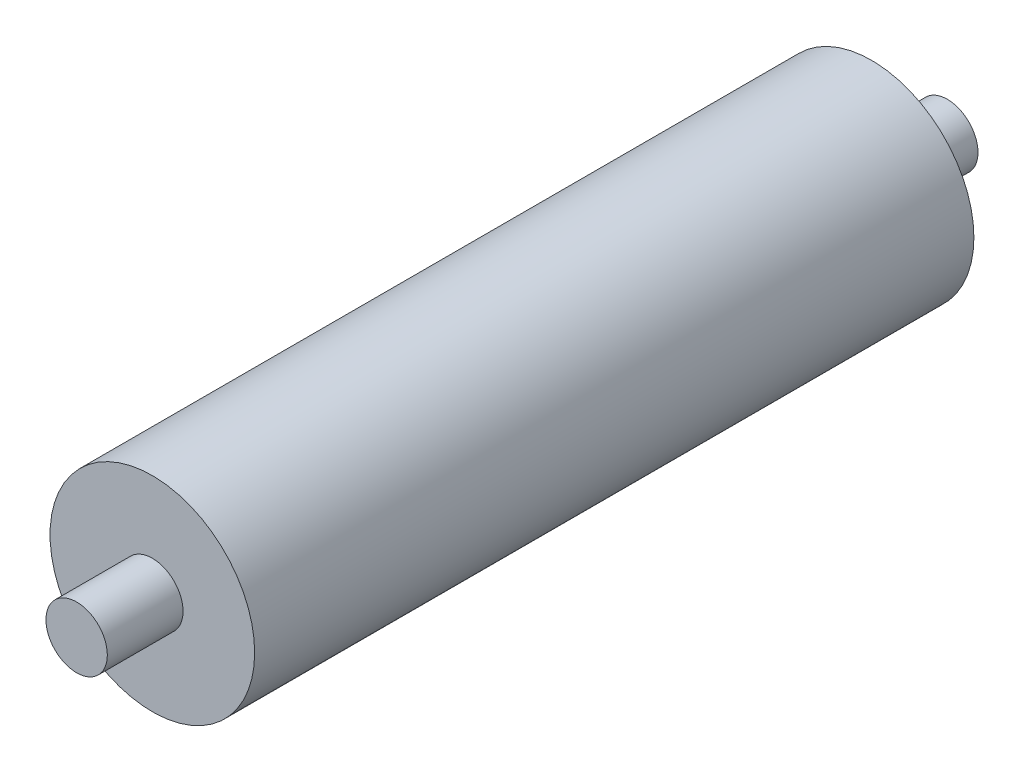
ISO-10303-21;
HEADER;
FILE_DESCRIPTION(('STEP AP214'),'2;1');
FILE_NAME('part.step','',(''),(''),'','','');
FILE_SCHEMA(('AUTOMOTIVE_DESIGN { 1 0 10303 214 1 1 1 1 }'));
ENDSEC;
DATA;
#1=APPLICATION_CONTEXT('core data for automotive mechanical design processes');
#2=APPLICATION_PROTOCOL_DEFINITION('international standard','automotive_design',2000,#1);
#3=PRODUCT_CONTEXT('',#1,'mechanical');
#4=PRODUCT('Part','Part','',(#3));
#5=PRODUCT_RELATED_PRODUCT_CATEGORY('part','',(#4));
#6=PRODUCT_DEFINITION_FORMATION('','',#4);
#7=PRODUCT_DEFINITION_CONTEXT('part definition',#1,'design');
#8=PRODUCT_DEFINITION('design','',#6,#7);
#9=PRODUCT_DEFINITION_SHAPE('','',#8);
#10=(LENGTH_UNIT() NAMED_UNIT(*) SI_UNIT(.MILLI.,.METRE.));
#11=(NAMED_UNIT(*) PLANE_ANGLE_UNIT() SI_UNIT($,.RADIAN.));
#12=(NAMED_UNIT(*) SI_UNIT($,.STERADIAN.) SOLID_ANGLE_UNIT());
#13=UNCERTAINTY_MEASURE_WITH_UNIT(LENGTH_MEASURE(1.E-05),#10,'distance_accuracy_value','');
#14=(GEOMETRIC_REPRESENTATION_CONTEXT(3) GLOBAL_UNCERTAINTY_ASSIGNED_CONTEXT((#13)) GLOBAL_UNIT_ASSIGNED_CONTEXT((#10,
#11,#12)) REPRESENTATION_CONTEXT('',''));
#15=CARTESIAN_POINT('',(0.,0.,0.));
#16=DIRECTION('',(0.,0.,1.));
#17=DIRECTION('',(1.,0.,0.));
#18=AXIS2_PLACEMENT_3D('',#15,#16,#17);
#19=CARTESIAN_POINT('',(0.,0.,35.15));
#20=DIRECTION('',(0.,0.,-1.));
#21=DIRECTION('',(-1.,0.,0.));
#22=AXIS2_PLACEMENT_3D('',#19,#20,#21);
#23=CYLINDRICAL_SURFACE('',#22,5.);
#24=CARTESIAN_POINT('',(0.,0.,35.15));
#25=DIRECTION('',(0.,0.,1.));
#26=DIRECTION('',(1.,0.,0.));
#27=AXIS2_PLACEMENT_3D('',#24,#25,#26);
#28=CIRCLE('',#27,5.);
#29=CARTESIAN_POINT('',(5.,0.,35.15));
#30=VERTEX_POINT('',#29);
#31=EDGE_CURVE('E41',#30,#30,#28,.T.);
#32=ORIENTED_EDGE('',*,*,#31,.F.);
#33=EDGE_LOOP('',(#32));
#34=FACE_BOUND('',#33,.T.);
#35=CARTESIAN_POINT('',(0.,0.,0.));
#36=DIRECTION('',(0.,0.,1.));
#37=DIRECTION('',(1.,0.,0.));
#38=AXIS2_PLACEMENT_3D('',#35,#36,#37);
#39=CIRCLE('',#38,5.);
#40=CARTESIAN_POINT('',(5.,0.,0.));
#41=VERTEX_POINT('',#40);
#42=EDGE_CURVE('E45',#41,#41,#39,.T.);
#43=ORIENTED_EDGE('',*,*,#42,.T.);
#44=EDGE_LOOP('',(#43));
#45=FACE_BOUND('',#44,.T.);
#46=ADVANCED_FACE('F35',(#34,#45),#23,.T.);
#47=CARTESIAN_POINT('',(0.,0.,35.15));
#48=DIRECTION('',(0.,0.,1.));
#49=DIRECTION('',(1.,0.,0.));
#50=AXIS2_PLACEMENT_3D('',#47,#48,#49);
#51=PLANE('',#50);
#52=CARTESIAN_POINT('',(0.,0.,35.15));
#53=DIRECTION('',(0.,0.,1.));
#54=DIRECTION('',(1.,0.,0.));
#55=AXIS2_PLACEMENT_3D('',#52,#53,#54);
#56=CIRCLE('',#55,1.5);
#57=CARTESIAN_POINT('',(1.5,0.,35.15));
#58=VERTEX_POINT('',#57);
#59=EDGE_CURVE('E55',#58,#58,#56,.T.);
#60=ORIENTED_EDGE('',*,*,#59,.F.);
#61=EDGE_LOOP('',(#60));
#62=FACE_BOUND('',#61,.T.);
#63=ORIENTED_EDGE('',*,*,#31,.T.);
#64=EDGE_LOOP('',(#63));
#65=FACE_BOUND('',#64,.T.);
#66=ADVANCED_FACE('F70',(#62,#65),#51,.T.);
#67=CARTESIAN_POINT('',(0.,0.,0.));
#68=DIRECTION('',(0.,0.,1.));
#69=DIRECTION('',(1.,0.,0.));
#70=AXIS2_PLACEMENT_3D('',#67,#68,#69);
#71=PLANE('',#70);
#72=CARTESIAN_POINT('',(0.,0.,0.));
#73=DIRECTION('',(0.,0.,1.));
#74=DIRECTION('',(1.,0.,0.));
#75=AXIS2_PLACEMENT_3D('',#72,#73,#74);
#76=CIRCLE('',#75,1.5);
#77=CARTESIAN_POINT('',(1.5,0.,0.));
#78=VERTEX_POINT('',#77);
#79=EDGE_CURVE('E10',#78,#78,#76,.F.);
#80=ORIENTED_EDGE('',*,*,#79,.F.);
#81=EDGE_LOOP('',(#80));
#82=FACE_BOUND('',#81,.T.);
#83=ORIENTED_EDGE('',*,*,#42,.F.);
#84=EDGE_LOOP('',(#83));
#85=FACE_BOUND('',#84,.T.);
#86=ADVANCED_FACE('F72',(#82,#85),#71,.F.);
#87=CARTESIAN_POINT('',(0.,0.,-3.7));
#88=DIRECTION('',(0.,0.,1.));
#89=DIRECTION('',(1.,0.,0.));
#90=AXIS2_PLACEMENT_3D('',#87,#88,#89);
#91=CYLINDRICAL_SURFACE('',#90,1.5);
#92=CARTESIAN_POINT('',(0.,0.,-3.7));
#93=DIRECTION('',(0.,0.,-1.));
#94=DIRECTION('',(-1.,0.,0.));
#95=AXIS2_PLACEMENT_3D('',#92,#93,#94);
#96=CIRCLE('',#95,1.5);
#97=CARTESIAN_POINT('',(-1.5,0.,-3.7));
#98=VERTEX_POINT('',#97);
#99=EDGE_CURVE('E50',#98,#98,#96,.T.);
#100=ORIENTED_EDGE('',*,*,#99,.F.);
#101=EDGE_LOOP('',(#100));
#102=FACE_BOUND('',#101,.T.);
#103=ORIENTED_EDGE('',*,*,#79,.T.);
#104=EDGE_LOOP('',(#103));
#105=FACE_BOUND('',#104,.T.);
#106=ADVANCED_FACE('F78',(#102,#105),#91,.T.);
#107=CARTESIAN_POINT('',(0.,0.,-3.7));
#108=DIRECTION('',(0.,0.,-1.));
#109=DIRECTION('',(-1.,0.,0.));
#110=AXIS2_PLACEMENT_3D('',#107,#108,#109);
#111=PLANE('',#110);
#112=ORIENTED_EDGE('',*,*,#99,.T.);
#113=EDGE_LOOP('',(#112));
#114=FACE_BOUND('',#113,.T.);
#115=ADVANCED_FACE('F66',(#114),#111,.T.);
#116=CARTESIAN_POINT('',(0.,0.,38.85));
#117=DIRECTION('',(0.,0.,-1.));
#118=DIRECTION('',(-1.,0.,0.));
#119=AXIS2_PLACEMENT_3D('',#116,#117,#118);
#120=CYLINDRICAL_SURFACE('',#119,1.5);
#121=CARTESIAN_POINT('',(0.,0.,38.85));
#122=DIRECTION('',(0.,0.,1.));
#123=DIRECTION('',(1.,0.,0.));
#124=AXIS2_PLACEMENT_3D('',#121,#122,#123);
#125=CIRCLE('',#124,1.5);
#126=CARTESIAN_POINT('',(1.5,0.,38.85));
#127=VERTEX_POINT('',#126);
#128=EDGE_CURVE('E54',#127,#127,#125,.T.);
#129=ORIENTED_EDGE('',*,*,#128,.F.);
#130=EDGE_LOOP('',(#129));
#131=FACE_BOUND('',#130,.T.);
#132=ORIENTED_EDGE('',*,*,#59,.T.);
#133=EDGE_LOOP('',(#132));
#134=FACE_BOUND('',#133,.T.);
#135=ADVANCED_FACE('F63',(#131,#134),#120,.T.);
#136=CARTESIAN_POINT('',(0.,0.,38.85));
#137=DIRECTION('',(0.,0.,1.));
#138=DIRECTION('',(1.,0.,0.));
#139=AXIS2_PLACEMENT_3D('',#136,#137,#138);
#140=PLANE('',#139);
#141=ORIENTED_EDGE('',*,*,#128,.T.);
#142=EDGE_LOOP('',(#141));
#143=FACE_BOUND('',#142,.T.);
#144=ADVANCED_FACE('F61',(#143),#140,.T.);
#145=CLOSED_SHELL('',(#46,#66,#86,#106,#115,#135,#144));
#146=MANIFOLD_SOLID_BREP('B2',#145);
#147=ADVANCED_BREP_SHAPE_REPRESENTATION('',(#18,#146),#14);
#148=SHAPE_DEFINITION_REPRESENTATION(#9,#147);
ENDSEC;
END-ISO-10303-21;
